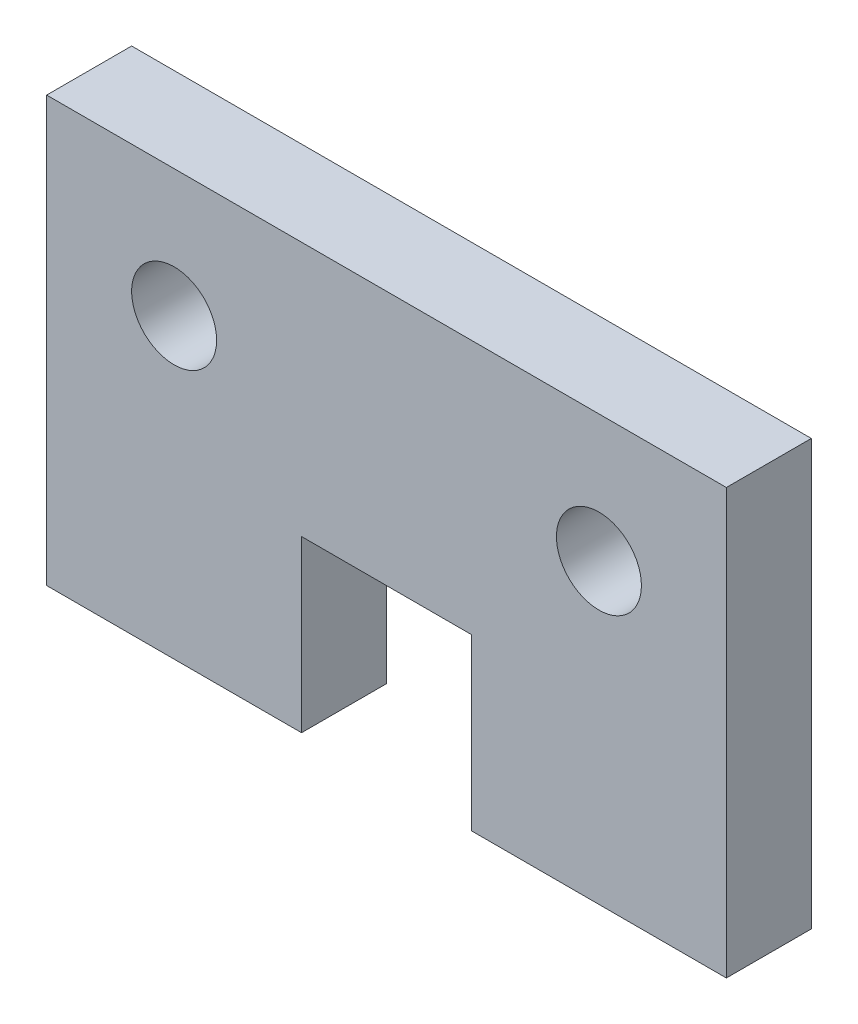
ISO-10303-21;
HEADER;
FILE_DESCRIPTION(('STEP AP214'),'2;1');
FILE_NAME('part.step','',(''),(''),'','','');
FILE_SCHEMA(('AUTOMOTIVE_DESIGN { 1 0 10303 214 1 1 1 1 }'));
ENDSEC;
DATA;
#1=APPLICATION_CONTEXT('core data for automotive mechanical design processes');
#2=APPLICATION_PROTOCOL_DEFINITION('international standard','automotive_design',2000,#1);
#3=PRODUCT_CONTEXT('',#1,'mechanical');
#4=PRODUCT('Part','Part','',(#3));
#5=PRODUCT_RELATED_PRODUCT_CATEGORY('part','',(#4));
#6=PRODUCT_DEFINITION_FORMATION('','',#4);
#7=PRODUCT_DEFINITION_CONTEXT('part definition',#1,'design');
#8=PRODUCT_DEFINITION('design','',#6,#7);
#9=PRODUCT_DEFINITION_SHAPE('','',#8);
#10=(LENGTH_UNIT() NAMED_UNIT(*) SI_UNIT(.MILLI.,.METRE.));
#11=(NAMED_UNIT(*) PLANE_ANGLE_UNIT() SI_UNIT($,.RADIAN.));
#12=(NAMED_UNIT(*) SI_UNIT($,.STERADIAN.) SOLID_ANGLE_UNIT());
#13=UNCERTAINTY_MEASURE_WITH_UNIT(LENGTH_MEASURE(1.E-05),#10,'distance_accuracy_value','');
#14=(GEOMETRIC_REPRESENTATION_CONTEXT(3) GLOBAL_UNCERTAINTY_ASSIGNED_CONTEXT((#13)) GLOBAL_UNIT_ASSIGNED_CONTEXT((#10,
#11,#12)) REPRESENTATION_CONTEXT('',''));
#15=CARTESIAN_POINT('',(0.,0.,0.));
#16=DIRECTION('',(0.,0.,1.));
#17=DIRECTION('',(1.,0.,0.));
#18=AXIS2_PLACEMENT_3D('',#15,#16,#17);
#19=CARTESIAN_POINT('',(0.,0.,12.7));
#20=DIRECTION('',(0.,0.,1.));
#21=DIRECTION('',(1.,0.,0.));
#22=AXIS2_PLACEMENT_3D('',#19,#20,#21);
#23=PLANE('',#22);
#24=CARTESIAN_POINT('',(-27.2030864197531,27.2030864197531,12.7));
#25=DIRECTION('',(0.,0.,1.));
#26=DIRECTION('',(1.,0.,0.));
#27=AXIS2_PLACEMENT_3D('',#24,#25,#26);
#28=CIRCLE('',#27,6.35);
#29=CARTESIAN_POINT('',(-20.8530864197531,27.2030864197531,12.7));
#30=VERTEX_POINT('',#29);
#31=EDGE_CURVE('E146',#30,#30,#28,.T.);
#32=ORIENTED_EDGE('',*,*,#31,.F.);
#33=EDGE_LOOP('',(#32));
#34=FACE_BOUND('',#33,.T.);
#35=DIRECTION('',(-1.,0.,0.));
#36=VECTOR('',#35,1.);
#37=CARTESIAN_POINT('',(55.3469135802469,46.2530864197531,12.7));
#38=LINE('',#37,#36);
#39=CARTESIAN_POINT('',(55.3469135802469,46.2530864197531,12.7));
#40=VERTEX_POINT('',#39);
#41=CARTESIAN_POINT('',(-46.2530864197531,46.2530864197531,12.7));
#42=VERTEX_POINT('',#41);
#43=EDGE_CURVE('E164',#40,#42,#38,.T.);
#44=ORIENTED_EDGE('',*,*,#43,.T.);
#45=DIRECTION('',(0.,-1.,0.));
#46=VECTOR('',#45,1.);
#47=CARTESIAN_POINT('',(-46.2530864197531,46.2530864197531,12.7));
#48=LINE('',#47,#46);
#49=CARTESIAN_POINT('',(-46.2530864197531,-17.2469135802469,12.7));
#50=VERTEX_POINT('',#49);
#51=EDGE_CURVE('E100',#42,#50,#48,.T.);
#52=ORIENTED_EDGE('',*,*,#51,.T.);
#53=DIRECTION('',(1.,0.,0.));
#54=VECTOR('',#53,1.);
#55=CARTESIAN_POINT('',(-46.2530864197531,-17.2469135802469,12.7));
#56=LINE('',#55,#54);
#57=CARTESIAN_POINT('',(-8.15308641975306,-17.2469135802469,12.7));
#58=VERTEX_POINT('',#57);
#59=EDGE_CURVE('E185',#50,#58,#56,.T.);
#60=ORIENTED_EDGE('',*,*,#59,.T.);
#61=DIRECTION('',(0.,1.,0.));
#62=VECTOR('',#61,1.);
#63=CARTESIAN_POINT('',(-8.15308641975306,-17.2469135802469,12.7));
#64=LINE('',#63,#62);
#65=CARTESIAN_POINT('',(-8.15308641975306,8.15308641975308,12.7));
#66=VERTEX_POINT('',#65);
#67=EDGE_CURVE('E199',#58,#66,#64,.T.);
#68=ORIENTED_EDGE('',*,*,#67,.T.);
#69=DIRECTION('',(1.,0.,0.));
#70=VECTOR('',#69,1.);
#71=CARTESIAN_POINT('',(-8.15308641975306,8.15308641975308,12.7));
#72=LINE('',#71,#70);
#73=CARTESIAN_POINT('',(17.2469135802469,8.15308641975308,12.7));
#74=VERTEX_POINT('',#73);
#75=EDGE_CURVE('E119',#66,#74,#72,.T.);
#76=ORIENTED_EDGE('',*,*,#75,.T.);
#77=DIRECTION('',(0.,-1.,0.));
#78=VECTOR('',#77,1.);
#79=CARTESIAN_POINT('',(17.2469135802469,8.15308641975308,12.7));
#80=LINE('',#79,#78);
#81=CARTESIAN_POINT('',(17.2469135802469,-17.2469135802469,12.7));
#82=VERTEX_POINT('',#81);
#83=EDGE_CURVE('E113',#74,#82,#80,.T.);
#84=ORIENTED_EDGE('',*,*,#83,.T.);
#85=DIRECTION('',(1.,0.,0.));
#86=VECTOR('',#85,1.);
#87=CARTESIAN_POINT('',(17.2469135802469,-17.2469135802469,12.7));
#88=LINE('',#87,#86);
#89=CARTESIAN_POINT('',(55.3469135802469,-17.2469135802469,12.7));
#90=VERTEX_POINT('',#89);
#91=EDGE_CURVE('E117',#82,#90,#88,.T.);
#92=ORIENTED_EDGE('',*,*,#91,.T.);
#93=DIRECTION('',(0.,1.,0.));
#94=VECTOR('',#93,1.);
#95=CARTESIAN_POINT('',(55.3469135802469,-17.2469135802469,12.7));
#96=LINE('',#95,#94);
#97=EDGE_CURVE('E57',#90,#40,#96,.T.);
#98=ORIENTED_EDGE('',*,*,#97,.T.);
#99=EDGE_LOOP('',(#44,#52,#60,#68,#76,#84,#92,#98));
#100=FACE_BOUND('',#99,.T.);
#101=CARTESIAN_POINT('',(36.2969135802469,27.2030864197531,12.7));
#102=DIRECTION('',(0.,0.,1.));
#103=DIRECTION('',(1.,0.,0.));
#104=AXIS2_PLACEMENT_3D('',#101,#102,#103);
#105=CIRCLE('',#104,6.35);
#106=CARTESIAN_POINT('',(42.6469135802469,27.2030864197531,12.7));
#107=VERTEX_POINT('',#106);
#108=EDGE_CURVE('E213',#107,#107,#105,.T.);
#109=ORIENTED_EDGE('',*,*,#108,.F.);
#110=EDGE_LOOP('',(#109));
#111=FACE_BOUND('',#110,.T.);
#112=ADVANCED_FACE('F39',(#34,#100,#111),#23,.T.);
#113=CARTESIAN_POINT('',(0.,0.,0.));
#114=DIRECTION('',(0.,0.,1.));
#115=DIRECTION('',(1.,0.,0.));
#116=AXIS2_PLACEMENT_3D('',#113,#114,#115);
#117=PLANE('',#116);
#118=DIRECTION('',(-1.,0.,0.));
#119=VECTOR('',#118,1.);
#120=CARTESIAN_POINT('',(55.3469135802469,46.2530864197531,0.));
#121=LINE('',#120,#119);
#122=CARTESIAN_POINT('',(55.3469135802469,46.2530864197531,0.));
#123=VERTEX_POINT('',#122);
#124=CARTESIAN_POINT('',(-46.2530864197531,46.2530864197531,0.));
#125=VERTEX_POINT('',#124);
#126=EDGE_CURVE('E141',#123,#125,#121,.T.);
#127=ORIENTED_EDGE('',*,*,#126,.F.);
#128=DIRECTION('',(0.,1.,0.));
#129=VECTOR('',#128,1.);
#130=CARTESIAN_POINT('',(55.3469135802469,-17.2469135802469,0.));
#131=LINE('',#130,#129);
#132=CARTESIAN_POINT('',(55.3469135802469,-17.2469135802469,0.));
#133=VERTEX_POINT('',#132);
#134=EDGE_CURVE('E92',#133,#123,#131,.T.);
#135=ORIENTED_EDGE('',*,*,#134,.F.);
#136=DIRECTION('',(1.,0.,0.));
#137=VECTOR('',#136,1.);
#138=CARTESIAN_POINT('',(17.2469135802469,-17.2469135802469,0.));
#139=LINE('',#138,#137);
#140=CARTESIAN_POINT('',(17.2469135802469,-17.2469135802469,0.));
#141=VERTEX_POINT('',#140);
#142=EDGE_CURVE('E86',#141,#133,#139,.T.);
#143=ORIENTED_EDGE('',*,*,#142,.F.);
#144=DIRECTION('',(0.,-1.,0.));
#145=VECTOR('',#144,1.);
#146=CARTESIAN_POINT('',(17.2469135802469,8.15308641975308,0.));
#147=LINE('',#146,#145);
#148=CARTESIAN_POINT('',(17.2469135802469,8.15308641975308,0.));
#149=VERTEX_POINT('',#148);
#150=EDGE_CURVE('E128',#149,#141,#147,.T.);
#151=ORIENTED_EDGE('',*,*,#150,.F.);
#152=DIRECTION('',(1.,0.,0.));
#153=VECTOR('',#152,1.);
#154=CARTESIAN_POINT('',(-8.15308641975306,8.15308641975308,0.));
#155=LINE('',#154,#153);
#156=CARTESIAN_POINT('',(-8.15308641975306,8.15308641975308,0.));
#157=VERTEX_POINT('',#156);
#158=EDGE_CURVE('E155',#157,#149,#155,.T.);
#159=ORIENTED_EDGE('',*,*,#158,.F.);
#160=DIRECTION('',(0.,1.,0.));
#161=VECTOR('',#160,1.);
#162=CARTESIAN_POINT('',(-8.15308641975306,-17.2469135802469,0.));
#163=LINE('',#162,#161);
#164=CARTESIAN_POINT('',(-8.15308641975306,-17.2469135802469,0.));
#165=VERTEX_POINT('',#164);
#166=EDGE_CURVE('E152',#165,#157,#163,.T.);
#167=ORIENTED_EDGE('',*,*,#166,.F.);
#168=DIRECTION('',(1.,0.,0.));
#169=VECTOR('',#168,1.);
#170=CARTESIAN_POINT('',(-46.2530864197531,-17.2469135802469,0.));
#171=LINE('',#170,#169);
#172=CARTESIAN_POINT('',(-46.2530864197531,-17.2469135802469,0.));
#173=VERTEX_POINT('',#172);
#174=EDGE_CURVE('E149',#173,#165,#171,.T.);
#175=ORIENTED_EDGE('',*,*,#174,.F.);
#176=DIRECTION('',(0.,-1.,0.));
#177=VECTOR('',#176,1.);
#178=CARTESIAN_POINT('',(-46.2530864197531,46.2530864197531,0.));
#179=LINE('',#178,#177);
#180=EDGE_CURVE('E145',#125,#173,#179,.T.);
#181=ORIENTED_EDGE('',*,*,#180,.F.);
#182=EDGE_LOOP('',(#127,#135,#143,#151,#159,#167,#175,#181));
#183=FACE_BOUND('',#182,.T.);
#184=CARTESIAN_POINT('',(-27.2030864197531,27.2030864197531,0.));
#185=DIRECTION('',(0.,0.,1.));
#186=DIRECTION('',(1.,0.,0.));
#187=AXIS2_PLACEMENT_3D('',#184,#185,#186);
#188=CIRCLE('',#187,6.35);
#189=CARTESIAN_POINT('',(-20.8530864197531,27.2030864197531,0.));
#190=VERTEX_POINT('',#189);
#191=EDGE_CURVE('E209',#190,#190,#188,.T.);
#192=ORIENTED_EDGE('',*,*,#191,.T.);
#193=EDGE_LOOP('',(#192));
#194=FACE_BOUND('',#193,.T.);
#195=CARTESIAN_POINT('',(36.2969135802469,27.2030864197531,0.));
#196=DIRECTION('',(0.,0.,1.));
#197=DIRECTION('',(1.,0.,0.));
#198=AXIS2_PLACEMENT_3D('',#195,#196,#197);
#199=CIRCLE('',#198,6.35);
#200=CARTESIAN_POINT('',(42.6469135802469,27.2030864197531,0.));
#201=VERTEX_POINT('',#200);
#202=EDGE_CURVE('E217',#201,#201,#199,.T.);
#203=ORIENTED_EDGE('',*,*,#202,.T.);
#204=EDGE_LOOP('',(#203));
#205=FACE_BOUND('',#204,.T.);
#206=ADVANCED_FACE('F189',(#183,#194,#205),#117,.F.);
#207=CARTESIAN_POINT('',(55.3469135802469,46.2530864197531,12.7));
#208=DIRECTION('',(0.,-1.,0.));
#209=DIRECTION('',(1.,0.,0.));
#210=AXIS2_PLACEMENT_3D('',#207,#208,#209);
#211=PLANE('',#210);
#212=ORIENTED_EDGE('',*,*,#126,.T.);
#213=DIRECTION('',(0.,0.,-1.));
#214=VECTOR('',#213,1.);
#215=CARTESIAN_POINT('',(-46.2530864197531,46.2530864197531,12.7));
#216=LINE('',#215,#214);
#217=EDGE_CURVE('E11',#42,#125,#216,.T.);
#218=ORIENTED_EDGE('',*,*,#217,.F.);
#219=ORIENTED_EDGE('',*,*,#43,.F.);
#220=DIRECTION('',(0.,0.,-1.));
#221=VECTOR('',#220,1.);
#222=CARTESIAN_POINT('',(55.3469135802469,46.2530864197531,12.7));
#223=LINE('',#222,#221);
#224=EDGE_CURVE('E137',#40,#123,#223,.T.);
#225=ORIENTED_EDGE('',*,*,#224,.T.);
#226=EDGE_LOOP('',(#212,#218,#219,#225));
#227=FACE_BOUND('',#226,.T.);
#228=ADVANCED_FACE('F41',(#227),#211,.F.);
#229=CARTESIAN_POINT('',(-46.2530864197531,46.2530864197531,12.7));
#230=DIRECTION('',(1.,0.,0.));
#231=DIRECTION('',(0.,0.,-1.));
#232=AXIS2_PLACEMENT_3D('',#229,#230,#231);
#233=PLANE('',#232);
#234=ORIENTED_EDGE('',*,*,#180,.T.);
#235=DIRECTION('',(0.,0.,-1.));
#236=VECTOR('',#235,1.);
#237=CARTESIAN_POINT('',(-46.2530864197531,-17.2469135802469,12.7));
#238=LINE('',#237,#236);
#239=EDGE_CURVE('E49',#50,#173,#238,.T.);
#240=ORIENTED_EDGE('',*,*,#239,.F.);
#241=ORIENTED_EDGE('',*,*,#51,.F.);
#242=ORIENTED_EDGE('',*,*,#217,.T.);
#243=EDGE_LOOP('',(#234,#240,#241,#242));
#244=FACE_BOUND('',#243,.T.);
#245=ADVANCED_FACE('F251',(#244),#233,.F.);
#246=CARTESIAN_POINT('',(-46.2530864197531,-17.2469135802469,12.7));
#247=DIRECTION('',(0.,1.,0.));
#248=DIRECTION('',(0.,0.,1.));
#249=AXIS2_PLACEMENT_3D('',#246,#247,#248);
#250=PLANE('',#249);
#251=ORIENTED_EDGE('',*,*,#174,.T.);
#252=DIRECTION('',(0.,0.,-1.));
#253=VECTOR('',#252,1.);
#254=CARTESIAN_POINT('',(-8.15308641975306,-17.2469135802469,12.7));
#255=LINE('',#254,#253);
#256=EDGE_CURVE('E175',#58,#165,#255,.T.);
#257=ORIENTED_EDGE('',*,*,#256,.F.);
#258=ORIENTED_EDGE('',*,*,#59,.F.);
#259=ORIENTED_EDGE('',*,*,#239,.T.);
#260=EDGE_LOOP('',(#251,#257,#258,#259));
#261=FACE_BOUND('',#260,.T.);
#262=ADVANCED_FACE('F183',(#261),#250,.F.);
#263=CARTESIAN_POINT('',(-8.15308641975306,-17.2469135802469,12.7));
#264=DIRECTION('',(-1.,0.,0.));
#265=DIRECTION('',(0.,-1.,0.));
#266=AXIS2_PLACEMENT_3D('',#263,#264,#265);
#267=PLANE('',#266);
#268=ORIENTED_EDGE('',*,*,#166,.T.);
#269=DIRECTION('',(0.,0.,-1.));
#270=VECTOR('',#269,1.);
#271=CARTESIAN_POINT('',(-8.15308641975306,8.15308641975308,12.7));
#272=LINE('',#271,#270);
#273=EDGE_CURVE('E171',#66,#157,#272,.T.);
#274=ORIENTED_EDGE('',*,*,#273,.F.);
#275=ORIENTED_EDGE('',*,*,#67,.F.);
#276=ORIENTED_EDGE('',*,*,#256,.T.);
#277=EDGE_LOOP('',(#268,#274,#275,#276));
#278=FACE_BOUND('',#277,.T.);
#279=ADVANCED_FACE('F194',(#278),#267,.F.);
#280=CARTESIAN_POINT('',(-8.15308641975306,8.15308641975308,12.7));
#281=DIRECTION('',(0.,1.,0.));
#282=DIRECTION('',(0.,0.,1.));
#283=AXIS2_PLACEMENT_3D('',#280,#281,#282);
#284=PLANE('',#283);
#285=ORIENTED_EDGE('',*,*,#158,.T.);
#286=DIRECTION('',(0.,0.,-1.));
#287=VECTOR('',#286,1.);
#288=CARTESIAN_POINT('',(17.2469135802469,8.15308641975308,12.7));
#289=LINE('',#288,#287);
#290=EDGE_CURVE('E130',#74,#149,#289,.T.);
#291=ORIENTED_EDGE('',*,*,#290,.F.);
#292=ORIENTED_EDGE('',*,*,#75,.F.);
#293=ORIENTED_EDGE('',*,*,#273,.T.);
#294=EDGE_LOOP('',(#285,#291,#292,#293));
#295=FACE_BOUND('',#294,.T.);
#296=ADVANCED_FACE('F197',(#295),#284,.F.);
#297=CARTESIAN_POINT('',(17.2469135802469,8.15308641975308,12.7));
#298=DIRECTION('',(1.,0.,0.));
#299=DIRECTION('',(0.,1.,0.));
#300=AXIS2_PLACEMENT_3D('',#297,#298,#299);
#301=PLANE('',#300);
#302=ORIENTED_EDGE('',*,*,#150,.T.);
#303=DIRECTION('',(0.,0.,-1.));
#304=VECTOR('',#303,1.);
#305=CARTESIAN_POINT('',(17.2469135802469,-17.2469135802469,12.7));
#306=LINE('',#305,#304);
#307=EDGE_CURVE('E125',#82,#141,#306,.T.);
#308=ORIENTED_EDGE('',*,*,#307,.F.);
#309=ORIENTED_EDGE('',*,*,#83,.F.);
#310=ORIENTED_EDGE('',*,*,#290,.T.);
#311=EDGE_LOOP('',(#302,#308,#309,#310));
#312=FACE_BOUND('',#311,.T.);
#313=ADVANCED_FACE('F126',(#312),#301,.F.);
#314=CARTESIAN_POINT('',(17.2469135802469,-17.2469135802469,12.7));
#315=DIRECTION('',(0.,1.,0.));
#316=DIRECTION('',(0.,0.,1.));
#317=AXIS2_PLACEMENT_3D('',#314,#315,#316);
#318=PLANE('',#317);
#319=ORIENTED_EDGE('',*,*,#142,.T.);
#320=DIRECTION('',(0.,0.,-1.));
#321=VECTOR('',#320,1.);
#322=CARTESIAN_POINT('',(55.3469135802469,-17.2469135802469,12.7));
#323=LINE('',#322,#321);
#324=EDGE_CURVE('E131',#90,#133,#323,.T.);
#325=ORIENTED_EDGE('',*,*,#324,.F.);
#326=ORIENTED_EDGE('',*,*,#91,.F.);
#327=ORIENTED_EDGE('',*,*,#307,.T.);
#328=EDGE_LOOP('',(#319,#325,#326,#327));
#329=FACE_BOUND('',#328,.T.);
#330=ADVANCED_FACE('F133',(#329),#318,.F.);
#331=CARTESIAN_POINT('',(55.3469135802469,-17.2469135802469,12.7));
#332=DIRECTION('',(-1.,0.,0.));
#333=DIRECTION('',(0.,0.,1.));
#334=AXIS2_PLACEMENT_3D('',#331,#332,#333);
#335=PLANE('',#334);
#336=ORIENTED_EDGE('',*,*,#134,.T.);
#337=ORIENTED_EDGE('',*,*,#224,.F.);
#338=ORIENTED_EDGE('',*,*,#97,.F.);
#339=ORIENTED_EDGE('',*,*,#324,.T.);
#340=EDGE_LOOP('',(#336,#337,#338,#339));
#341=FACE_BOUND('',#340,.T.);
#342=ADVANCED_FACE('F239',(#341),#335,.F.);
#343=CARTESIAN_POINT('',(-27.2030864197531,27.2030864197531,12.7));
#344=DIRECTION('',(0.,0.,-1.));
#345=DIRECTION('',(-1.,0.,0.));
#346=AXIS2_PLACEMENT_3D('',#343,#344,#345);
#347=CYLINDRICAL_SURFACE('',#346,6.35);
#348=ORIENTED_EDGE('',*,*,#31,.T.);
#349=EDGE_LOOP('',(#348));
#350=FACE_BOUND('',#349,.T.);
#351=ORIENTED_EDGE('',*,*,#191,.F.);
#352=EDGE_LOOP('',(#351));
#353=FACE_BOUND('',#352,.T.);
#354=ADVANCED_FACE('F236',(#350,#353),#347,.F.);
#355=CARTESIAN_POINT('',(36.2969135802469,27.2030864197531,12.7));
#356=DIRECTION('',(0.,0.,-1.));
#357=DIRECTION('',(-1.,0.,0.));
#358=AXIS2_PLACEMENT_3D('',#355,#356,#357);
#359=CYLINDRICAL_SURFACE('',#358,6.35);
#360=ORIENTED_EDGE('',*,*,#108,.T.);
#361=EDGE_LOOP('',(#360));
#362=FACE_BOUND('',#361,.T.);
#363=ORIENTED_EDGE('',*,*,#202,.F.);
#364=EDGE_LOOP('',(#363));
#365=FACE_BOUND('',#364,.T.);
#366=ADVANCED_FACE('F225',(#362,#365),#359,.F.);
#367=CLOSED_SHELL('',(#112,#206,#228,#245,#262,#279,#296,#313,#330,#342,#354,#366));
#368=MANIFOLD_SOLID_BREP('B2',#367);
#369=ADVANCED_BREP_SHAPE_REPRESENTATION('',(#18,#368),#14);
#370=SHAPE_DEFINITION_REPRESENTATION(#9,#369);
ENDSEC;
END-ISO-10303-21;
